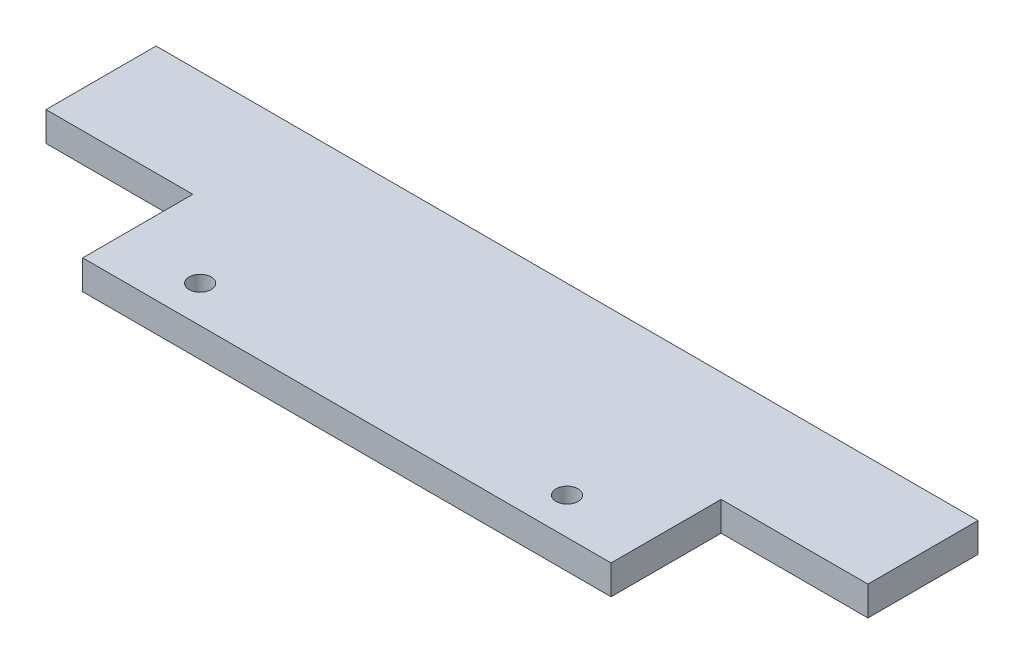
ISO-10303-21;
HEADER;
FILE_DESCRIPTION(('STEP AP214'),'2;1');
FILE_NAME('part.step','',(''),(''),'','','');
FILE_SCHEMA(('AUTOMOTIVE_DESIGN { 1 0 10303 214 1 1 1 1 }'));
ENDSEC;
DATA;
#1=APPLICATION_CONTEXT('core data for automotive mechanical design processes');
#2=APPLICATION_PROTOCOL_DEFINITION('international standard','automotive_design',2000,#1);
#3=PRODUCT_CONTEXT('',#1,'mechanical');
#4=PRODUCT('Part','Part','',(#3));
#5=PRODUCT_RELATED_PRODUCT_CATEGORY('part','',(#4));
#6=PRODUCT_DEFINITION_FORMATION('','',#4);
#7=PRODUCT_DEFINITION_CONTEXT('part definition',#1,'design');
#8=PRODUCT_DEFINITION('design','',#6,#7);
#9=PRODUCT_DEFINITION_SHAPE('','',#8);
#10=(LENGTH_UNIT() NAMED_UNIT(*) SI_UNIT(.MILLI.,.METRE.));
#11=(NAMED_UNIT(*) PLANE_ANGLE_UNIT() SI_UNIT($,.RADIAN.));
#12=(NAMED_UNIT(*) SI_UNIT($,.STERADIAN.) SOLID_ANGLE_UNIT());
#13=UNCERTAINTY_MEASURE_WITH_UNIT(LENGTH_MEASURE(1.E-05),#10,'distance_accuracy_value','');
#14=(GEOMETRIC_REPRESENTATION_CONTEXT(3) GLOBAL_UNCERTAINTY_ASSIGNED_CONTEXT((#13)) GLOBAL_UNIT_ASSIGNED_CONTEXT((#10,
#11,#12)) REPRESENTATION_CONTEXT('',''));
#15=CARTESIAN_POINT('',(0.,0.,0.));
#16=DIRECTION('',(0.,0.,1.));
#17=DIRECTION('',(1.,0.,0.));
#18=AXIS2_PLACEMENT_3D('',#15,#16,#17);
#19=CARTESIAN_POINT('',(-32.1787709497207,4.,-13.659217877095));
#20=DIRECTION('',(1.,0.,0.));
#21=DIRECTION('',(0.,0.,-1.));
#22=AXIS2_PLACEMENT_3D('',#19,#20,#21);
#23=PLANE('',#22);
#24=DIRECTION('',(0.,1.,0.));
#25=VECTOR('',#24,1.);
#26=CARTESIAN_POINT('',(-32.1787709497207,0.,1.34078212290503));
#27=LINE('',#26,#25);
#28=CARTESIAN_POINT('',(-32.1787709497207,0.,1.34078212290503));
#29=VERTEX_POINT('',#28);
#30=CARTESIAN_POINT('',(-32.1787709497207,4.,1.34078212290503));
#31=VERTEX_POINT('',#30);
#32=EDGE_CURVE('E49',#29,#31,#27,.T.);
#33=ORIENTED_EDGE('',*,*,#32,.F.);
#34=DIRECTION('',(0.,0.,1.));
#35=VECTOR('',#34,1.);
#36=CARTESIAN_POINT('',(-32.1787709497207,0.,-13.659217877095));
#37=LINE('',#36,#35);
#38=CARTESIAN_POINT('',(-32.1787709497207,0.,16.340782122905));
#39=VERTEX_POINT('',#38);
#40=EDGE_CURVE('E140',#29,#39,#37,.T.);
#41=ORIENTED_EDGE('',*,*,#40,.T.);
#42=DIRECTION('',(0.,-1.,0.));
#43=VECTOR('',#42,1.);
#44=CARTESIAN_POINT('',(-32.1787709497207,4.,16.340782122905));
#45=LINE('',#44,#43);
#46=CARTESIAN_POINT('',(-32.1787709497207,4.,16.340782122905));
#47=VERTEX_POINT('',#46);
#48=EDGE_CURVE('E11',#47,#39,#45,.T.);
#49=ORIENTED_EDGE('',*,*,#48,.F.);
#50=DIRECTION('',(0.,0.,1.));
#51=VECTOR('',#50,1.);
#52=CARTESIAN_POINT('',(-32.1787709497207,4.,-13.659217877095));
#53=LINE('',#52,#51);
#54=EDGE_CURVE('E110',#31,#47,#53,.T.);
#55=ORIENTED_EDGE('',*,*,#54,.F.);
#56=EDGE_LOOP('',(#33,#41,#49,#55));
#57=FACE_BOUND('',#56,.T.);
#58=ADVANCED_FACE('F33',(#57),#23,.F.);
#59=CARTESIAN_POINT('',(-32.1787709497207,4.,16.340782122905));
#60=DIRECTION('',(0.,0.,-1.));
#61=DIRECTION('',(-1.,0.,0.));
#62=AXIS2_PLACEMENT_3D('',#59,#60,#61);
#63=PLANE('',#62);
#64=DIRECTION('',(1.,0.,0.));
#65=VECTOR('',#64,1.);
#66=CARTESIAN_POINT('',(-32.1787709497207,0.,16.340782122905));
#67=LINE('',#66,#65);
#68=CARTESIAN_POINT('',(39.8212290502793,0.,16.340782122905));
#69=VERTEX_POINT('',#68);
#70=EDGE_CURVE('E181',#39,#69,#67,.T.);
#71=ORIENTED_EDGE('',*,*,#70,.T.);
#72=DIRECTION('',(0.,-1.,0.));
#73=VECTOR('',#72,1.);
#74=CARTESIAN_POINT('',(39.8212290502793,4.,16.340782122905));
#75=LINE('',#74,#73);
#76=CARTESIAN_POINT('',(39.8212290502793,4.,16.340782122905));
#77=VERTEX_POINT('',#76);
#78=EDGE_CURVE('E41',#77,#69,#75,.T.);
#79=ORIENTED_EDGE('',*,*,#78,.F.);
#80=DIRECTION('',(1.,0.,0.));
#81=VECTOR('',#80,1.);
#82=CARTESIAN_POINT('',(-32.1787709497207,4.,16.340782122905));
#83=LINE('',#82,#81);
#84=EDGE_CURVE('E139',#47,#77,#83,.T.);
#85=ORIENTED_EDGE('',*,*,#84,.F.);
#86=ORIENTED_EDGE('',*,*,#48,.T.);
#87=EDGE_LOOP('',(#71,#79,#85,#86));
#88=FACE_BOUND('',#87,.T.);
#89=ADVANCED_FACE('F217',(#88),#63,.F.);
#90=CARTESIAN_POINT('',(39.8212290502793,4.,-13.659217877095));
#91=DIRECTION('',(-1.,0.,0.));
#92=DIRECTION('',(0.,0.,1.));
#93=AXIS2_PLACEMENT_3D('',#90,#91,#92);
#94=PLANE('',#93);
#95=DIRECTION('',(0.,0.,-1.));
#96=VECTOR('',#95,1.);
#97=CARTESIAN_POINT('',(39.8212290502793,0.,-13.659217877095));
#98=LINE('',#97,#96);
#99=CARTESIAN_POINT('',(39.8212290502793,0.,1.34078212290503));
#100=VERTEX_POINT('',#99);
#101=EDGE_CURVE('E111',#69,#100,#98,.T.);
#102=ORIENTED_EDGE('',*,*,#101,.T.);
#103=DIRECTION('',(0.,1.,0.));
#104=VECTOR('',#103,1.);
#105=CARTESIAN_POINT('',(39.8212290502793,0.,1.34078212290503));
#106=LINE('',#105,#104);
#107=CARTESIAN_POINT('',(39.8212290502793,4.,1.34078212290503));
#108=VERTEX_POINT('',#107);
#109=EDGE_CURVE('E162',#100,#108,#106,.T.);
#110=ORIENTED_EDGE('',*,*,#109,.T.);
#111=DIRECTION('',(0.,0.,-1.));
#112=VECTOR('',#111,1.);
#113=CARTESIAN_POINT('',(39.8212290502793,4.,-13.659217877095));
#114=LINE('',#113,#112);
#115=EDGE_CURVE('E149',#77,#108,#114,.T.);
#116=ORIENTED_EDGE('',*,*,#115,.F.);
#117=ORIENTED_EDGE('',*,*,#78,.T.);
#118=EDGE_LOOP('',(#102,#110,#116,#117));
#119=FACE_BOUND('',#118,.T.);
#120=ADVANCED_FACE('F207',(#119),#94,.F.);
#121=CARTESIAN_POINT('',(-32.1787709497207,4.,-13.659217877095));
#122=DIRECTION('',(0.,0.,1.));
#123=DIRECTION('',(1.,0.,0.));
#124=AXIS2_PLACEMENT_3D('',#121,#122,#123);
#125=PLANE('',#124);
#126=DIRECTION('',(-1.,0.,0.));
#127=VECTOR('',#126,1.);
#128=CARTESIAN_POINT('',(-32.1787709497207,0.,-13.659217877095));
#129=LINE('',#128,#127);
#130=CARTESIAN_POINT('',(59.8212290502793,0.,-13.659217877095));
#131=VERTEX_POINT('',#130);
#132=CARTESIAN_POINT('',(-52.1787709497207,0.,-13.659217877095));
#133=VERTEX_POINT('',#132);
#134=EDGE_CURVE('E99',#131,#133,#129,.T.);
#135=ORIENTED_EDGE('',*,*,#134,.T.);
#136=DIRECTION('',(0.,1.,0.));
#137=VECTOR('',#136,1.);
#138=CARTESIAN_POINT('',(-52.1787709497207,0.,-13.659217877095));
#139=LINE('',#138,#137);
#140=CARTESIAN_POINT('',(-52.1787709497207,4.,-13.659217877095));
#141=VERTEX_POINT('',#140);
#142=EDGE_CURVE('E102',#133,#141,#139,.T.);
#143=ORIENTED_EDGE('',*,*,#142,.T.);
#144=DIRECTION('',(-1.,0.,0.));
#145=VECTOR('',#144,1.);
#146=CARTESIAN_POINT('',(-32.1787709497207,4.,-13.659217877095));
#147=LINE('',#146,#145);
#148=CARTESIAN_POINT('',(59.8212290502793,4.,-13.659217877095));
#149=VERTEX_POINT('',#148);
#150=EDGE_CURVE('E152',#149,#141,#147,.T.);
#151=ORIENTED_EDGE('',*,*,#150,.F.);
#152=DIRECTION('',(0.,1.,0.));
#153=VECTOR('',#152,1.);
#154=CARTESIAN_POINT('',(59.8212290502793,0.,-13.659217877095));
#155=LINE('',#154,#153);
#156=EDGE_CURVE('E105',#131,#149,#155,.T.);
#157=ORIENTED_EDGE('',*,*,#156,.F.);
#158=EDGE_LOOP('',(#135,#143,#151,#157));
#159=FACE_BOUND('',#158,.T.);
#160=ADVANCED_FACE('F101',(#159),#125,.F.);
#161=CARTESIAN_POINT('',(0.,4.,0.));
#162=DIRECTION('',(0.,1.,0.));
#163=DIRECTION('',(0.,0.,1.));
#164=AXIS2_PLACEMENT_3D('',#161,#162,#163);
#165=PLANE('',#164);
#166=CARTESIAN_POINT('',(28.8212290502793,4.,11.340782122905));
#167=DIRECTION('',(0.,1.,0.));
#168=DIRECTION('',(0.,0.,1.));
#169=AXIS2_PLACEMENT_3D('',#166,#167,#168);
#170=CIRCLE('',#169,1.5);
#171=CARTESIAN_POINT('',(28.8212290502793,4.,12.840782122905));
#172=VERTEX_POINT('',#171);
#173=EDGE_CURVE('E175',#172,#172,#170,.T.);
#174=ORIENTED_EDGE('',*,*,#173,.F.);
#175=EDGE_LOOP('',(#174));
#176=FACE_BOUND('',#175,.T.);
#177=CARTESIAN_POINT('',(-21.1787709497207,4.,11.340782122905));
#178=DIRECTION('',(0.,1.,0.));
#179=DIRECTION('',(0.,0.,1.));
#180=AXIS2_PLACEMENT_3D('',#177,#178,#179);
#181=CIRCLE('',#180,1.5);
#182=CARTESIAN_POINT('',(-21.1787709497207,4.,12.840782122905));
#183=VERTEX_POINT('',#182);
#184=EDGE_CURVE('E146',#183,#183,#181,.T.);
#185=ORIENTED_EDGE('',*,*,#184,.F.);
#186=EDGE_LOOP('',(#185));
#187=FACE_BOUND('',#186,.T.);
#188=ORIENTED_EDGE('',*,*,#150,.T.);
#189=DIRECTION('',(0.,0.,1.));
#190=VECTOR('',#189,1.);
#191=CARTESIAN_POINT('',(-52.1787709497207,4.,-13.659217877095));
#192=LINE('',#191,#190);
#193=CARTESIAN_POINT('',(-52.1787709497207,4.,1.34078212290503));
#194=VERTEX_POINT('',#193);
#195=EDGE_CURVE('E119',#141,#194,#192,.T.);
#196=ORIENTED_EDGE('',*,*,#195,.T.);
#197=DIRECTION('',(1.,0.,0.));
#198=VECTOR('',#197,1.);
#199=CARTESIAN_POINT('',(-32.1787709497207,4.,1.34078212290503));
#200=LINE('',#199,#198);
#201=EDGE_CURVE('E125',#194,#31,#200,.T.);
#202=ORIENTED_EDGE('',*,*,#201,.T.);
#203=ORIENTED_EDGE('',*,*,#54,.T.);
#204=ORIENTED_EDGE('',*,*,#84,.T.);
#205=ORIENTED_EDGE('',*,*,#115,.T.);
#206=DIRECTION('',(1.,0.,0.));
#207=VECTOR('',#206,1.);
#208=CARTESIAN_POINT('',(39.8212290502793,4.,1.34078212290503));
#209=LINE('',#208,#207);
#210=CARTESIAN_POINT('',(59.8212290502793,4.,1.34078212290503));
#211=VERTEX_POINT('',#210);
#212=EDGE_CURVE('E57',#108,#211,#209,.T.);
#213=ORIENTED_EDGE('',*,*,#212,.T.);
#214=DIRECTION('',(0.,0.,-1.));
#215=VECTOR('',#214,1.);
#216=CARTESIAN_POINT('',(59.8212290502793,4.,-13.659217877095));
#217=LINE('',#216,#215);
#218=EDGE_CURVE('E159',#211,#149,#217,.T.);
#219=ORIENTED_EDGE('',*,*,#218,.T.);
#220=EDGE_LOOP('',(#188,#196,#202,#203,#204,#205,#213,#219));
#221=FACE_BOUND('',#220,.T.);
#222=ADVANCED_FACE('F187',(#176,#187,#221),#165,.T.);
#223=CARTESIAN_POINT('',(0.,0.,0.));
#224=DIRECTION('',(0.,1.,0.));
#225=DIRECTION('',(0.,0.,1.));
#226=AXIS2_PLACEMENT_3D('',#223,#224,#225);
#227=PLANE('',#226);
#228=CARTESIAN_POINT('',(28.8212290502793,0.,11.340782122905));
#229=DIRECTION('',(0.,1.,0.));
#230=DIRECTION('',(0.,0.,1.));
#231=AXIS2_PLACEMENT_3D('',#228,#229,#230);
#232=CIRCLE('',#231,1.5);
#233=CARTESIAN_POINT('',(28.8212290502793,0.,12.840782122905));
#234=VERTEX_POINT('',#233);
#235=EDGE_CURVE('E172',#234,#234,#232,.T.);
#236=ORIENTED_EDGE('',*,*,#235,.T.);
#237=EDGE_LOOP('',(#236));
#238=FACE_BOUND('',#237,.T.);
#239=CARTESIAN_POINT('',(-21.1787709497207,0.,11.340782122905));
#240=DIRECTION('',(0.,1.,0.));
#241=DIRECTION('',(0.,0.,1.));
#242=AXIS2_PLACEMENT_3D('',#239,#240,#241);
#243=CIRCLE('',#242,1.5);
#244=CARTESIAN_POINT('',(-21.1787709497207,0.,12.840782122905));
#245=VERTEX_POINT('',#244);
#246=EDGE_CURVE('E177',#245,#245,#243,.T.);
#247=ORIENTED_EDGE('',*,*,#246,.T.);
#248=EDGE_LOOP('',(#247));
#249=FACE_BOUND('',#248,.T.);
#250=ORIENTED_EDGE('',*,*,#40,.F.);
#251=DIRECTION('',(1.,0.,0.));
#252=VECTOR('',#251,1.);
#253=CARTESIAN_POINT('',(-32.1787709497207,0.,1.34078212290503));
#254=LINE('',#253,#252);
#255=CARTESIAN_POINT('',(-52.1787709497207,0.,1.34078212290503));
#256=VERTEX_POINT('',#255);
#257=EDGE_CURVE('E121',#256,#29,#254,.T.);
#258=ORIENTED_EDGE('',*,*,#257,.F.);
#259=DIRECTION('',(0.,0.,1.));
#260=VECTOR('',#259,1.);
#261=CARTESIAN_POINT('',(-52.1787709497207,0.,-13.659217877095));
#262=LINE('',#261,#260);
#263=EDGE_CURVE('E116',#133,#256,#262,.T.);
#264=ORIENTED_EDGE('',*,*,#263,.F.);
#265=ORIENTED_EDGE('',*,*,#134,.F.);
#266=DIRECTION('',(0.,0.,-1.));
#267=VECTOR('',#266,1.);
#268=CARTESIAN_POINT('',(59.8212290502793,0.,-13.659217877095));
#269=LINE('',#268,#267);
#270=CARTESIAN_POINT('',(59.8212290502793,0.,1.34078212290503));
#271=VERTEX_POINT('',#270);
#272=EDGE_CURVE('E166',#271,#131,#269,.T.);
#273=ORIENTED_EDGE('',*,*,#272,.F.);
#274=DIRECTION('',(1.,0.,0.));
#275=VECTOR('',#274,1.);
#276=CARTESIAN_POINT('',(39.8212290502793,0.,1.34078212290503));
#277=LINE('',#276,#275);
#278=EDGE_CURVE('E167',#100,#271,#277,.T.);
#279=ORIENTED_EDGE('',*,*,#278,.F.);
#280=ORIENTED_EDGE('',*,*,#101,.F.);
#281=ORIENTED_EDGE('',*,*,#70,.F.);
#282=EDGE_LOOP('',(#250,#258,#264,#265,#273,#279,#280,#281));
#283=FACE_BOUND('',#282,.T.);
#284=ADVANCED_FACE('F123',(#238,#249,#283),#227,.F.);
#285=CARTESIAN_POINT('',(-21.1787709497207,0.,11.340782122905));
#286=DIRECTION('',(0.,1.,0.));
#287=DIRECTION('',(0.,0.,1.));
#288=AXIS2_PLACEMENT_3D('',#285,#286,#287);
#289=CYLINDRICAL_SURFACE('',#288,1.5);
#290=ORIENTED_EDGE('',*,*,#246,.F.);
#291=EDGE_LOOP('',(#290));
#292=FACE_BOUND('',#291,.T.);
#293=ORIENTED_EDGE('',*,*,#184,.T.);
#294=EDGE_LOOP('',(#293));
#295=FACE_BOUND('',#294,.T.);
#296=ADVANCED_FACE('F185',(#292,#295),#289,.F.);
#297=CARTESIAN_POINT('',(28.8212290502793,0.,11.340782122905));
#298=DIRECTION('',(0.,1.,0.));
#299=DIRECTION('',(0.,0.,1.));
#300=AXIS2_PLACEMENT_3D('',#297,#298,#299);
#301=CYLINDRICAL_SURFACE('',#300,1.5);
#302=ORIENTED_EDGE('',*,*,#235,.F.);
#303=EDGE_LOOP('',(#302));
#304=FACE_BOUND('',#303,.T.);
#305=ORIENTED_EDGE('',*,*,#173,.T.);
#306=EDGE_LOOP('',(#305));
#307=FACE_BOUND('',#306,.T.);
#308=ADVANCED_FACE('F232',(#304,#307),#301,.F.);
#309=CARTESIAN_POINT('',(59.8212290502793,0.,-13.659217877095));
#310=DIRECTION('',(1.,0.,0.));
#311=DIRECTION('',(0.,0.,-1.));
#312=AXIS2_PLACEMENT_3D('',#309,#310,#311);
#313=PLANE('',#312);
#314=ORIENTED_EDGE('',*,*,#218,.F.);
#315=DIRECTION('',(0.,1.,0.));
#316=VECTOR('',#315,1.);
#317=CARTESIAN_POINT('',(59.8212290502793,0.,1.34078212290503));
#318=LINE('',#317,#316);
#319=EDGE_CURVE('E165',#271,#211,#318,.T.);
#320=ORIENTED_EDGE('',*,*,#319,.F.);
#321=ORIENTED_EDGE('',*,*,#272,.T.);
#322=ORIENTED_EDGE('',*,*,#156,.T.);
#323=EDGE_LOOP('',(#314,#320,#321,#322));
#324=FACE_BOUND('',#323,.T.);
#325=ADVANCED_FACE('F214',(#324),#313,.T.);
#326=CARTESIAN_POINT('',(39.8212290502793,0.,1.34078212290503));
#327=DIRECTION('',(0.,0.,1.));
#328=DIRECTION('',(1.,0.,0.));
#329=AXIS2_PLACEMENT_3D('',#326,#327,#328);
#330=PLANE('',#329);
#331=ORIENTED_EDGE('',*,*,#212,.F.);
#332=ORIENTED_EDGE('',*,*,#109,.F.);
#333=ORIENTED_EDGE('',*,*,#278,.T.);
#334=ORIENTED_EDGE('',*,*,#319,.T.);
#335=EDGE_LOOP('',(#331,#332,#333,#334));
#336=FACE_BOUND('',#335,.T.);
#337=ADVANCED_FACE('F213',(#336),#330,.T.);
#338=CARTESIAN_POINT('',(-32.1787709497207,0.,1.34078212290503));
#339=DIRECTION('',(0.,0.,1.));
#340=DIRECTION('',(1.,0.,0.));
#341=AXIS2_PLACEMENT_3D('',#338,#339,#340);
#342=PLANE('',#341);
#343=ORIENTED_EDGE('',*,*,#201,.F.);
#344=DIRECTION('',(0.,1.,0.));
#345=VECTOR('',#344,1.);
#346=CARTESIAN_POINT('',(-52.1787709497207,0.,1.34078212290503));
#347=LINE('',#346,#345);
#348=EDGE_CURVE('E120',#256,#194,#347,.T.);
#349=ORIENTED_EDGE('',*,*,#348,.F.);
#350=ORIENTED_EDGE('',*,*,#257,.T.);
#351=ORIENTED_EDGE('',*,*,#32,.T.);
#352=EDGE_LOOP('',(#343,#349,#350,#351));
#353=FACE_BOUND('',#352,.T.);
#354=ADVANCED_FACE('F239',(#353),#342,.T.);
#355=CARTESIAN_POINT('',(-52.1787709497207,0.,-13.659217877095));
#356=DIRECTION('',(-1.,0.,0.));
#357=DIRECTION('',(0.,0.,1.));
#358=AXIS2_PLACEMENT_3D('',#355,#356,#357);
#359=PLANE('',#358);
#360=ORIENTED_EDGE('',*,*,#195,.F.);
#361=ORIENTED_EDGE('',*,*,#142,.F.);
#362=ORIENTED_EDGE('',*,*,#263,.T.);
#363=ORIENTED_EDGE('',*,*,#348,.T.);
#364=EDGE_LOOP('',(#360,#361,#362,#363));
#365=FACE_BOUND('',#364,.T.);
#366=ADVANCED_FACE('F115',(#365),#359,.T.);
#367=CLOSED_SHELL('',(#58,#89,#120,#160,#222,#284,#296,#308,#325,#337,#354,#366));
#368=MANIFOLD_SOLID_BREP('B2',#367);
#369=ADVANCED_BREP_SHAPE_REPRESENTATION('',(#18,#368),#14);
#370=SHAPE_DEFINITION_REPRESENTATION(#9,#369);
ENDSEC;
END-ISO-10303-21;
